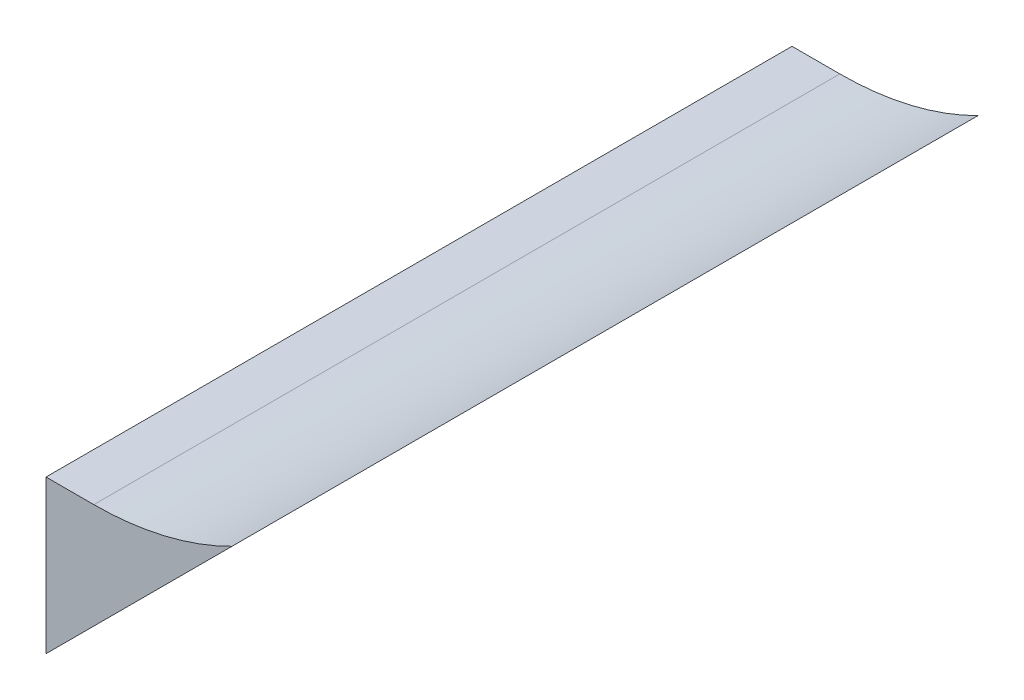
ISO-10303-21;
HEADER;
FILE_DESCRIPTION(('STEP AP214'),'2;1');
FILE_NAME('part.step','',(''),(''),'','','');
FILE_SCHEMA(('AUTOMOTIVE_DESIGN { 1 0 10303 214 1 1 1 1 }'));
ENDSEC;
DATA;
#1=APPLICATION_CONTEXT('core data for automotive mechanical design processes');
#2=APPLICATION_PROTOCOL_DEFINITION('international standard','automotive_design',2000,#1);
#3=PRODUCT_CONTEXT('',#1,'mechanical');
#4=PRODUCT('Part','Part','',(#3));
#5=PRODUCT_RELATED_PRODUCT_CATEGORY('part','',(#4));
#6=PRODUCT_DEFINITION_FORMATION('','',#4);
#7=PRODUCT_DEFINITION_CONTEXT('part definition',#1,'design');
#8=PRODUCT_DEFINITION('design','',#6,#7);
#9=PRODUCT_DEFINITION_SHAPE('','',#8);
#10=(LENGTH_UNIT() NAMED_UNIT(*) SI_UNIT(.MILLI.,.METRE.));
#11=(NAMED_UNIT(*) PLANE_ANGLE_UNIT() SI_UNIT($,.RADIAN.));
#12=(NAMED_UNIT(*) SI_UNIT($,.STERADIAN.) SOLID_ANGLE_UNIT());
#13=UNCERTAINTY_MEASURE_WITH_UNIT(LENGTH_MEASURE(1.E-05),#10,'distance_accuracy_value','');
#14=(GEOMETRIC_REPRESENTATION_CONTEXT(3) GLOBAL_UNCERTAINTY_ASSIGNED_CONTEXT((#13)) GLOBAL_UNIT_ASSIGNED_CONTEXT((#10,
#11,#12)) REPRESENTATION_CONTEXT('',''));
#15=CARTESIAN_POINT('',(0.,0.,0.));
#16=DIRECTION('',(0.,0.,1.));
#17=DIRECTION('',(1.,0.,0.));
#18=AXIS2_PLACEMENT_3D('',#15,#16,#17);
#19=CARTESIAN_POINT('',(-321.,15.9999999999999,-39.));
#20=DIRECTION('',(0.,0.,1.));
#21=DIRECTION('',(1.,0.,0.));
#22=AXIS2_PLACEMENT_3D('',#19,#20,#21);
#23=CYLINDRICAL_SURFACE('',#22,15.9999999438255);
#24=CARTESIAN_POINT('',(-321.,15.9999999999999,0.));
#25=DIRECTION('',(0.,0.,-1.));
#26=DIRECTION('',(1.,0.,0.));
#27=AXIS2_PLACEMENT_3D('',#24,#25,#26);
#28=CIRCLE('',#27,15.9999999438255);
#29=CARTESIAN_POINT('',(-313.776683740062,1.72331625993809,0.));
#30=VERTEX_POINT('',#29);
#31=CARTESIAN_POINT('',(-321.,-1.21430643318376E-13,0.));
#32=VERTEX_POINT('',#31);
#33=EDGE_CURVE('E100',#30,#32,#28,.T.);
#34=ORIENTED_EDGE('',*,*,#33,.F.);
#35=DIRECTION('',(0.,0.,1.));
#36=VECTOR('',#35,1.);
#37=CARTESIAN_POINT('',(-313.776683740062,1.72331625993809,-39.));
#38=LINE('',#37,#36);
#39=CARTESIAN_POINT('',(-313.776683740062,1.72331625993809,-39.));
#40=VERTEX_POINT('',#39);
#41=EDGE_CURVE('E11',#40,#30,#38,.T.);
#42=ORIENTED_EDGE('',*,*,#41,.F.);
#43=CARTESIAN_POINT('',(-321.,15.9999999999999,-39.));
#44=DIRECTION('',(0.,0.,-1.));
#45=DIRECTION('',(1.,0.,0.));
#46=AXIS2_PLACEMENT_3D('',#43,#44,#45);
#47=CIRCLE('',#46,15.9999999438255);
#48=CARTESIAN_POINT('',(-321.,-1.21430643318376E-13,-39.));
#49=VERTEX_POINT('',#48);
#50=EDGE_CURVE('E95',#40,#49,#47,.T.);
#51=ORIENTED_EDGE('',*,*,#50,.T.);
#52=DIRECTION('',(0.,0.,1.));
#53=VECTOR('',#52,1.);
#54=CARTESIAN_POINT('',(-321.,-1.21430643318376E-13,-39.));
#55=LINE('',#54,#53);
#56=EDGE_CURVE('E39',#49,#32,#55,.T.);
#57=ORIENTED_EDGE('',*,*,#56,.T.);
#58=EDGE_LOOP('',(#34,#42,#51,#57));
#59=FACE_BOUND('',#58,.T.);
#60=ADVANCED_FACE('F36',(#59),#23,.F.);
#61=CARTESIAN_POINT('',(-315.5,0.,-39.));
#62=DIRECTION('',(0.707106781186545,-0.70710678118655,0.));
#63=DIRECTION('',(0.70710678118655,0.707106781186545,0.));
#64=AXIS2_PLACEMENT_3D('',#61,#62,#63);
#65=PLANE('',#64);
#66=DIRECTION('',(0.70710678118655,0.707106781186545,0.));
#67=VECTOR('',#66,1.);
#68=CARTESIAN_POINT('',(-315.5,0.,0.));
#69=LINE('',#68,#67);
#70=CARTESIAN_POINT('',(-323.5,-8.00000000000002,0.));
#71=VERTEX_POINT('',#70);
#72=EDGE_CURVE('E67',#71,#30,#69,.T.);
#73=ORIENTED_EDGE('',*,*,#72,.F.);
#74=DIRECTION('',(0.,0.,1.));
#75=VECTOR('',#74,1.);
#76=CARTESIAN_POINT('',(-323.5,-8.00000000000002,-39.));
#77=LINE('',#76,#75);
#78=CARTESIAN_POINT('',(-323.5,-8.00000000000002,-39.));
#79=VERTEX_POINT('',#78);
#80=EDGE_CURVE('E45',#79,#71,#77,.T.);
#81=ORIENTED_EDGE('',*,*,#80,.F.);
#82=DIRECTION('',(0.707106781186552,0.707106781186543,0.));
#83=VECTOR('',#82,1.);
#84=CARTESIAN_POINT('',(-323.5,-8.00000000000002,-39.));
#85=LINE('',#84,#83);
#86=EDGE_CURVE('E53',#79,#40,#85,.T.);
#87=ORIENTED_EDGE('',*,*,#86,.T.);
#88=ORIENTED_EDGE('',*,*,#41,.T.);
#89=EDGE_LOOP('',(#73,#81,#87,#88));
#90=FACE_BOUND('',#89,.T.);
#91=ADVANCED_FACE('F111',(#90),#65,.T.);
#92=CARTESIAN_POINT('',(-323.5,0.,-39.));
#93=DIRECTION('',(-1.,0.,0.));
#94=DIRECTION('',(0.,0.,1.));
#95=AXIS2_PLACEMENT_3D('',#92,#93,#94);
#96=PLANE('',#95);
#97=DIRECTION('',(0.,-1.,0.));
#98=VECTOR('',#97,1.);
#99=CARTESIAN_POINT('',(-323.5,0.,0.));
#100=LINE('',#99,#98);
#101=CARTESIAN_POINT('',(-323.5,0.,0.));
#102=VERTEX_POINT('',#101);
#103=EDGE_CURVE('E86',#102,#71,#100,.T.);
#104=ORIENTED_EDGE('',*,*,#103,.F.);
#105=DIRECTION('',(0.,0.,1.));
#106=VECTOR('',#105,1.);
#107=CARTESIAN_POINT('',(-323.5,0.,-39.));
#108=LINE('',#107,#106);
#109=CARTESIAN_POINT('',(-323.5,0.,-39.));
#110=VERTEX_POINT('',#109);
#111=EDGE_CURVE('E81',#110,#102,#108,.T.);
#112=ORIENTED_EDGE('',*,*,#111,.F.);
#113=DIRECTION('',(0.,-1.,0.));
#114=VECTOR('',#113,1.);
#115=CARTESIAN_POINT('',(-323.5,0.,-39.));
#116=LINE('',#115,#114);
#117=EDGE_CURVE('E84',#110,#79,#116,.T.);
#118=ORIENTED_EDGE('',*,*,#117,.T.);
#119=ORIENTED_EDGE('',*,*,#80,.T.);
#120=EDGE_LOOP('',(#104,#112,#118,#119));
#121=FACE_BOUND('',#120,.T.);
#122=ADVANCED_FACE('F83',(#121),#96,.T.);
#123=CARTESIAN_POINT('',(-323.5,0.,-39.));
#124=DIRECTION('',(0.,1.,0.));
#125=DIRECTION('',(-1.,0.,0.));
#126=AXIS2_PLACEMENT_3D('',#123,#124,#125);
#127=PLANE('',#126);
#128=DIRECTION('',(-1.,0.,0.));
#129=VECTOR('',#128,1.);
#130=CARTESIAN_POINT('',(-323.5,0.,0.));
#131=LINE('',#130,#129);
#132=EDGE_CURVE('E103',#32,#102,#131,.T.);
#133=ORIENTED_EDGE('',*,*,#132,.F.);
#134=ORIENTED_EDGE('',*,*,#56,.F.);
#135=DIRECTION('',(-1.,0.,0.));
#136=VECTOR('',#135,1.);
#137=CARTESIAN_POINT('',(-323.5,0.,-39.));
#138=LINE('',#137,#136);
#139=EDGE_CURVE('E91',#49,#110,#138,.T.);
#140=ORIENTED_EDGE('',*,*,#139,.T.);
#141=ORIENTED_EDGE('',*,*,#111,.T.);
#142=EDGE_LOOP('',(#133,#134,#140,#141));
#143=FACE_BOUND('',#142,.T.);
#144=ADVANCED_FACE('F94',(#143),#127,.T.);
#145=CARTESIAN_POINT('',(-321.,15.9999999999999,-39.));
#146=DIRECTION('',(0.,0.,1.));
#147=DIRECTION('',(1.,0.,0.));
#148=AXIS2_PLACEMENT_3D('',#145,#146,#147);
#149=PLANE('',#148);
#150=ORIENTED_EDGE('',*,*,#50,.F.);
#151=ORIENTED_EDGE('',*,*,#86,.F.);
#152=ORIENTED_EDGE('',*,*,#117,.F.);
#153=ORIENTED_EDGE('',*,*,#139,.F.);
#154=EDGE_LOOP('',(#150,#151,#152,#153));
#155=FACE_BOUND('',#154,.T.);
#156=ADVANCED_FACE('F90',(#155),#149,.F.);
#157=CARTESIAN_POINT('',(-321.,15.9999999999999,0.));
#158=DIRECTION('',(0.,0.,1.));
#159=DIRECTION('',(1.,0.,0.));
#160=AXIS2_PLACEMENT_3D('',#157,#158,#159);
#161=PLANE('',#160);
#162=ORIENTED_EDGE('',*,*,#33,.T.);
#163=ORIENTED_EDGE('',*,*,#132,.T.);
#164=ORIENTED_EDGE('',*,*,#103,.T.);
#165=ORIENTED_EDGE('',*,*,#72,.T.);
#166=EDGE_LOOP('',(#162,#163,#164,#165));
#167=FACE_BOUND('',#166,.T.);
#168=ADVANCED_FACE('F108',(#167),#161,.T.);
#169=CLOSED_SHELL('',(#60,#91,#122,#144,#156,#168));
#170=MANIFOLD_SOLID_BREP('B2',#169);
#171=ADVANCED_BREP_SHAPE_REPRESENTATION('',(#18,#170),#14);
#172=SHAPE_DEFINITION_REPRESENTATION(#9,#171);
ENDSEC;
END-ISO-10303-21;
